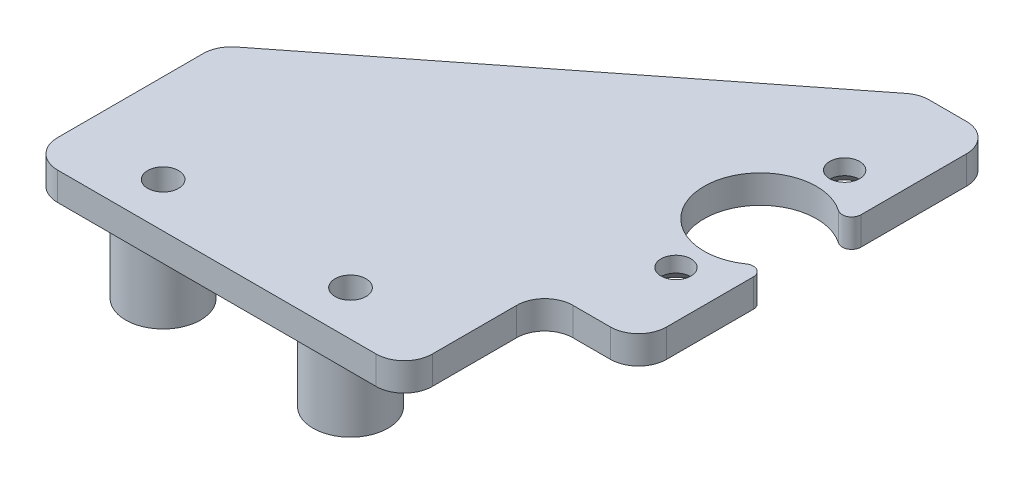
ISO-10303-21;
HEADER;
FILE_DESCRIPTION(('STEP AP214'),'2;1');
FILE_NAME('part.step','',(''),(''),'','','');
FILE_SCHEMA(('AUTOMOTIVE_DESIGN { 1 0 10303 214 1 1 1 1 }'));
ENDSEC;
DATA;
#1=APPLICATION_CONTEXT('core data for automotive mechanical design processes');
#2=APPLICATION_PROTOCOL_DEFINITION('international standard','automotive_design',2000,#1);
#3=PRODUCT_CONTEXT('',#1,'mechanical');
#4=PRODUCT('Part','Part','',(#3));
#5=PRODUCT_RELATED_PRODUCT_CATEGORY('part','',(#4));
#6=PRODUCT_DEFINITION_FORMATION('','',#4);
#7=PRODUCT_DEFINITION_CONTEXT('part definition',#1,'design');
#8=PRODUCT_DEFINITION('design','',#6,#7);
#9=PRODUCT_DEFINITION_SHAPE('','',#8);
#10=(LENGTH_UNIT() NAMED_UNIT(*) SI_UNIT(.MILLI.,.METRE.));
#11=(NAMED_UNIT(*) PLANE_ANGLE_UNIT() SI_UNIT($,.RADIAN.));
#12=(NAMED_UNIT(*) SI_UNIT($,.STERADIAN.) SOLID_ANGLE_UNIT());
#13=UNCERTAINTY_MEASURE_WITH_UNIT(LENGTH_MEASURE(1.E-05),#10,'distance_accuracy_value','');
#14=(GEOMETRIC_REPRESENTATION_CONTEXT(3) GLOBAL_UNCERTAINTY_ASSIGNED_CONTEXT((#13)) GLOBAL_UNIT_ASSIGNED_CONTEXT((#10,
#11,#12)) REPRESENTATION_CONTEXT('',''));
#15=CARTESIAN_POINT('',(0.,0.,0.));
#16=DIRECTION('',(0.,0.,1.));
#17=DIRECTION('',(1.,0.,0.));
#18=AXIS2_PLACEMENT_3D('',#15,#16,#17);
#19=CARTESIAN_POINT('',(0.,3.,-20.));
#20=DIRECTION('',(0.,0.,-1.));
#21=DIRECTION('',(-1.,0.,0.));
#22=AXIS2_PLACEMENT_3D('',#19,#20,#21);
#23=PLANE('',#22);
#24=DIRECTION('',(1.,0.,0.));
#25=VECTOR('',#24,1.);
#26=CARTESIAN_POINT('',(0.,3.,-20.));
#27=LINE('',#26,#25);
#28=CARTESIAN_POINT('',(18.0375892222086,3.,-20.));
#29=VERTEX_POINT('',#28);
#30=CARTESIAN_POINT('',(22.,3.,-20.));
#31=VERTEX_POINT('',#30);
#32=EDGE_CURVE('E411',#29,#31,#27,.T.);
#33=ORIENTED_EDGE('',*,*,#32,.T.);
#34=DIRECTION('',(0.,-1.,0.));
#35=VECTOR('',#34,1.);
#36=CARTESIAN_POINT('',(22.,3.,-20.));
#37=LINE('',#36,#35);
#38=CARTESIAN_POINT('',(22.,0.,-20.));
#39=VERTEX_POINT('',#38);
#40=EDGE_CURVE('E318',#31,#39,#37,.T.);
#41=ORIENTED_EDGE('',*,*,#40,.T.);
#42=DIRECTION('',(1.,0.,0.));
#43=VECTOR('',#42,1.);
#44=CARTESIAN_POINT('',(0.,0.,-20.));
#45=LINE('',#44,#43);
#46=CARTESIAN_POINT('',(18.0375892222086,0.,-20.));
#47=VERTEX_POINT('',#46);
#48=EDGE_CURVE('E181',#47,#39,#45,.T.);
#49=ORIENTED_EDGE('',*,*,#48,.F.);
#50=DIRECTION('',(0.,-1.,0.));
#51=VECTOR('',#50,1.);
#52=CARTESIAN_POINT('',(18.0375892222086,3.,-20.));
#53=LINE('',#52,#51);
#54=EDGE_CURVE('E315',#47,#29,#53,.F.);
#55=ORIENTED_EDGE('',*,*,#54,.T.);
#56=EDGE_LOOP('',(#33,#41,#49,#55));
#57=FACE_BOUND('',#56,.T.);
#58=ADVANCED_FACE('F43',(#57),#23,.T.);
#59=CARTESIAN_POINT('',(-25.,3.,0.));
#60=DIRECTION('',(-1.,0.,0.));
#61=DIRECTION('',(0.,0.,1.));
#62=AXIS2_PLACEMENT_3D('',#59,#60,#61);
#63=PLANE('',#62);
#64=DIRECTION('',(0.,0.,-1.));
#65=VECTOR('',#64,1.);
#66=CARTESIAN_POINT('',(-25.,3.,0.));
#67=LINE('',#66,#65);
#68=CARTESIAN_POINT('',(-25.,3.,30.));
#69=VERTEX_POINT('',#68);
#70=CARTESIAN_POINT('',(-25.,3.,14.4581058174496));
#71=VERTEX_POINT('',#70);
#72=EDGE_CURVE('E420',#69,#71,#67,.T.);
#73=ORIENTED_EDGE('',*,*,#72,.T.);
#74=DIRECTION('',(0.,-1.,0.));
#75=VECTOR('',#74,1.);
#76=CARTESIAN_POINT('',(-25.,3.,14.4581058174496));
#77=LINE('',#76,#75);
#78=CARTESIAN_POINT('',(-25.,0.,14.4581058174496));
#79=VERTEX_POINT('',#78);
#80=EDGE_CURVE('E259',#71,#79,#77,.T.);
#81=ORIENTED_EDGE('',*,*,#80,.T.);
#82=DIRECTION('',(0.,0.,-1.));
#83=VECTOR('',#82,1.);
#84=CARTESIAN_POINT('',(-25.,0.,0.));
#85=LINE('',#84,#83);
#86=CARTESIAN_POINT('',(-25.,0.,30.));
#87=VERTEX_POINT('',#86);
#88=EDGE_CURVE('E209',#87,#79,#85,.T.);
#89=ORIENTED_EDGE('',*,*,#88,.F.);
#90=DIRECTION('',(0.,-1.,0.));
#91=VECTOR('',#90,1.);
#92=CARTESIAN_POINT('',(-25.,3.,30.));
#93=LINE('',#92,#91);
#94=EDGE_CURVE('E256',#87,#69,#93,.F.);
#95=ORIENTED_EDGE('',*,*,#94,.T.);
#96=EDGE_LOOP('',(#73,#81,#89,#95));
#97=FACE_BOUND('',#96,.T.);
#98=ADVANCED_FACE('F371',(#97),#63,.T.);
#99=CARTESIAN_POINT('',(25.,3.,0.));
#100=DIRECTION('',(1.,0.,0.));
#101=DIRECTION('',(0.,0.,-1.));
#102=AXIS2_PLACEMENT_3D('',#99,#100,#101);
#103=PLANE('',#102);
#104=DIRECTION('',(0.,0.,1.));
#105=VECTOR('',#104,1.);
#106=CARTESIAN_POINT('',(25.,3.,0.));
#107=LINE('',#106,#105);
#108=CARTESIAN_POINT('',(25.,3.,5.74456264653803));
#109=VERTEX_POINT('',#108);
#110=CARTESIAN_POINT('',(25.,3.,15.));
#111=VERTEX_POINT('',#110);
#112=EDGE_CURVE('E406',#109,#111,#107,.T.);
#113=ORIENTED_EDGE('',*,*,#112,.T.);
#114=DIRECTION('',(0.,-1.,0.));
#115=VECTOR('',#114,1.);
#116=CARTESIAN_POINT('',(25.,3.,15.));
#117=LINE('',#116,#115);
#118=CARTESIAN_POINT('',(25.,0.,15.));
#119=VERTEX_POINT('',#118);
#120=EDGE_CURVE('E311',#111,#119,#117,.T.);
#121=ORIENTED_EDGE('',*,*,#120,.T.);
#122=DIRECTION('',(0.,0.,1.));
#123=VECTOR('',#122,1.);
#124=CARTESIAN_POINT('',(25.,0.,0.));
#125=LINE('',#124,#123);
#126=CARTESIAN_POINT('',(25.,0.,5.74456264653803));
#127=VERTEX_POINT('',#126);
#128=EDGE_CURVE('E184',#127,#119,#125,.T.);
#129=ORIENTED_EDGE('',*,*,#128,.F.);
#130=DIRECTION('',(0.,-1.,0.));
#131=VECTOR('',#130,1.);
#132=CARTESIAN_POINT('',(25.,3.,5.74456264653803));
#133=LINE('',#132,#131);
#134=EDGE_CURVE('E223',#127,#109,#133,.F.);
#135=ORIENTED_EDGE('',*,*,#134,.T.);
#136=EDGE_LOOP('',(#113,#121,#129,#135));
#137=FACE_BOUND('',#136,.T.);
#138=ADVANCED_FACE('F377',(#137),#103,.T.);
#139=CARTESIAN_POINT('',(0.,3.,0.));
#140=DIRECTION('',(0.,1.,0.));
#141=DIRECTION('',(0.,0.,1.));
#142=AXIS2_PLACEMENT_3D('',#139,#140,#141);
#143=PLANE('',#142);
#144=CARTESIAN_POINT('',(-15.5,3.,28.234562646538));
#145=DIRECTION('',(0.,-1.,0.));
#146=DIRECTION('',(0.,0.,-1.));
#147=AXIS2_PLACEMENT_3D('',#144,#145,#146);
#148=CIRCLE('',#147,1.65);
#149=CARTESIAN_POINT('',(-15.5,3.,26.584562646538));
#150=VERTEX_POINT('',#149);
#151=EDGE_CURVE('E451',#150,#150,#148,.T.);
#152=ORIENTED_EDGE('',*,*,#151,.T.);
#153=EDGE_LOOP('',(#152));
#154=FACE_BOUND('',#153,.T.);
#155=CARTESIAN_POINT('',(4.5,3.,28.234562646538));
#156=DIRECTION('',(0.,-1.,0.));
#157=DIRECTION('',(0.,0.,-1.));
#158=AXIS2_PLACEMENT_3D('',#155,#156,#157);
#159=CIRCLE('',#158,1.65);
#160=CARTESIAN_POINT('',(4.5,3.,26.584562646538));
#161=VERTEX_POINT('',#160);
#162=EDGE_CURVE('E453',#161,#161,#159,.T.);
#163=ORIENTED_EDGE('',*,*,#162,.T.);
#164=EDGE_LOOP('',(#163));
#165=FACE_BOUND('',#164,.T.);
#166=CARTESIAN_POINT('',(20.,3.,9.));
#167=DIRECTION('',(0.,1.,0.));
#168=DIRECTION('',(0.,0.,1.));
#169=AXIS2_PLACEMENT_3D('',#166,#167,#168);
#170=CIRCLE('',#169,1.6);
#171=CARTESIAN_POINT('',(20.,3.,10.6));
#172=VERTEX_POINT('',#171);
#173=EDGE_CURVE('E206',#172,#172,#170,.T.);
#174=ORIENTED_EDGE('',*,*,#173,.F.);
#175=EDGE_LOOP('',(#174));
#176=FACE_BOUND('',#175,.T.);
#177=CARTESIAN_POINT('',(20.,3.,-9.));
#178=DIRECTION('',(0.,1.,0.));
#179=DIRECTION('',(0.,0.,1.));
#180=AXIS2_PLACEMENT_3D('',#177,#178,#179);
#181=CIRCLE('',#180,1.6);
#182=CARTESIAN_POINT('',(20.,3.,-7.4));
#183=VERTEX_POINT('',#182);
#184=EDGE_CURVE('E200',#183,#183,#181,.T.);
#185=ORIENTED_EDGE('',*,*,#184,.F.);
#186=EDGE_LOOP('',(#185));
#187=FACE_BOUND('',#186,.T.);
#188=DIRECTION('',(0.786318338822423,0.,-0.617821551931904));
#189=VECTOR('',#188,1.);
#190=CARTESIAN_POINT('',(-25.,3.,13.));
#191=LINE('',#190,#189);
#192=CARTESIAN_POINT('',(-23.8534646557957,3.,12.0991508009823));
#193=VERTEX_POINT('',#192);
#194=CARTESIAN_POINT('',(16.1841245664129,3.,-19.3589550164673));
#195=VERTEX_POINT('',#194);
#196=EDGE_CURVE('E457',#193,#195,#191,.T.);
#197=ORIENTED_EDGE('',*,*,#196,.F.);
#198=CARTESIAN_POINT('',(-22.,3.,14.4581058174496));
#199=DIRECTION('',(0.,1.,0.));
#200=DIRECTION('',(0.,0.,1.));
#201=AXIS2_PLACEMENT_3D('',#198,#199,#200);
#202=CIRCLE('',#201,3.);
#203=EDGE_CURVE('E301',#193,#71,#202,.T.);
#204=ORIENTED_EDGE('',*,*,#203,.T.);
#205=ORIENTED_EDGE('',*,*,#72,.F.);
#206=CARTESIAN_POINT('',(-22.,3.,30.));
#207=DIRECTION('',(0.,1.,0.));
#208=DIRECTION('',(0.,0.,1.));
#209=AXIS2_PLACEMENT_3D('',#206,#207,#208);
#210=CIRCLE('',#209,3.);
#211=CARTESIAN_POINT('',(-22.,3.,33.));
#212=VERTEX_POINT('',#211);
#213=EDGE_CURVE('E298',#69,#212,#210,.T.);
#214=ORIENTED_EDGE('',*,*,#213,.T.);
#215=DIRECTION('',(-1.,0.,0.));
#216=VECTOR('',#215,1.);
#217=CARTESIAN_POINT('',(-25.,3.,33.));
#218=LINE('',#217,#216);
#219=CARTESIAN_POINT('',(12.,3.,33.));
#220=VERTEX_POINT('',#219);
#221=EDGE_CURVE('E428',#220,#212,#218,.T.);
#222=ORIENTED_EDGE('',*,*,#221,.F.);
#223=CARTESIAN_POINT('',(12.,3.,30.));
#224=DIRECTION('',(0.,1.,0.));
#225=DIRECTION('',(0.,0.,1.));
#226=AXIS2_PLACEMENT_3D('',#223,#224,#225);
#227=CIRCLE('',#226,3.);
#228=CARTESIAN_POINT('',(15.,3.,30.));
#229=VERTEX_POINT('',#228);
#230=EDGE_CURVE('E295',#220,#229,#227,.T.);
#231=ORIENTED_EDGE('',*,*,#230,.T.);
#232=DIRECTION('',(0.,0.,1.));
#233=VECTOR('',#232,1.);
#234=CARTESIAN_POINT('',(15.,3.,18.));
#235=LINE('',#234,#233);
#236=CARTESIAN_POINT('',(15.,3.,21.));
#237=VERTEX_POINT('',#236);
#238=EDGE_CURVE('E461',#237,#229,#235,.T.);
#239=ORIENTED_EDGE('',*,*,#238,.F.);
#240=CARTESIAN_POINT('',(18.,3.,21.));
#241=DIRECTION('',(0.,1.,0.));
#242=DIRECTION('',(0.,0.,1.));
#243=AXIS2_PLACEMENT_3D('',#240,#241,#242);
#244=CIRCLE('',#243,3.);
#245=CARTESIAN_POINT('',(18.,3.,18.));
#246=VERTEX_POINT('',#245);
#247=EDGE_CURVE('E327',#237,#246,#244,.F.);
#248=ORIENTED_EDGE('',*,*,#247,.T.);
#249=DIRECTION('',(-1.,0.,0.));
#250=VECTOR('',#249,1.);
#251=CARTESIAN_POINT('',(25.,3.,18.));
#252=LINE('',#251,#250);
#253=CARTESIAN_POINT('',(22.,3.,18.));
#254=VERTEX_POINT('',#253);
#255=EDGE_CURVE('E466',#254,#246,#252,.T.);
#256=ORIENTED_EDGE('',*,*,#255,.F.);
#257=CARTESIAN_POINT('',(22.,3.,15.));
#258=DIRECTION('',(0.,1.,0.));
#259=DIRECTION('',(0.,0.,1.));
#260=AXIS2_PLACEMENT_3D('',#257,#258,#259);
#261=CIRCLE('',#260,3.);
#262=EDGE_CURVE('E67',#254,#111,#261,.T.);
#263=ORIENTED_EDGE('',*,*,#262,.T.);
#264=ORIENTED_EDGE('',*,*,#112,.F.);
#265=CARTESIAN_POINT('',(24.,3.,5.74456264653803));
#266=DIRECTION('',(0.,1.,0.));
#267=DIRECTION('',(0.,0.,1.));
#268=AXIS2_PLACEMENT_3D('',#265,#266,#267);
#269=CIRCLE('',#268,1.);
#270=CARTESIAN_POINT('',(23.4285714285714,3.,4.92391083988974));
#271=VERTEX_POINT('',#270);
#272=EDGE_CURVE('E217',#109,#271,#269,.T.);
#273=ORIENTED_EDGE('',*,*,#272,.T.);
#274=CARTESIAN_POINT('',(20.,3.,0.));
#275=DIRECTION('',(0.,1.,0.));
#276=DIRECTION('',(0.,0.,1.));
#277=AXIS2_PLACEMENT_3D('',#274,#275,#276);
#278=CIRCLE('',#277,6.);
#279=CARTESIAN_POINT('',(23.4285714285714,3.,-4.92391083988974));
#280=VERTEX_POINT('',#279);
#281=EDGE_CURVE('E405',#280,#271,#278,.T.);
#282=ORIENTED_EDGE('',*,*,#281,.F.);
#283=CARTESIAN_POINT('',(24.,3.,-5.74456264653803));
#284=DIRECTION('',(0.,1.,0.));
#285=DIRECTION('',(0.,0.,1.));
#286=AXIS2_PLACEMENT_3D('',#283,#284,#285);
#287=CIRCLE('',#286,1.);
#288=CARTESIAN_POINT('',(25.,3.,-5.74456264653803));
#289=VERTEX_POINT('',#288);
#290=EDGE_CURVE('E220',#280,#289,#287,.T.);
#291=ORIENTED_EDGE('',*,*,#290,.T.);
#292=CARTESIAN_POINT('',(25.,3.,-17.));
#293=VERTEX_POINT('',#292);
#294=EDGE_CURVE('E197',#293,#289,#107,.T.);
#295=ORIENTED_EDGE('',*,*,#294,.F.);
#296=CARTESIAN_POINT('',(22.,3.,-17.));
#297=DIRECTION('',(0.,1.,0.));
#298=DIRECTION('',(0.,0.,1.));
#299=AXIS2_PLACEMENT_3D('',#296,#297,#298);
#300=CIRCLE('',#299,3.);
#301=EDGE_CURVE('E290',#293,#31,#300,.T.);
#302=ORIENTED_EDGE('',*,*,#301,.T.);
#303=ORIENTED_EDGE('',*,*,#32,.F.);
#304=CARTESIAN_POINT('',(18.0375892222086,3.,-17.));
#305=DIRECTION('',(0.,1.,0.));
#306=DIRECTION('',(0.,0.,1.));
#307=AXIS2_PLACEMENT_3D('',#304,#305,#306);
#308=CIRCLE('',#307,3.);
#309=EDGE_CURVE('E287',#29,#195,#308,.T.);
#310=ORIENTED_EDGE('',*,*,#309,.T.);
#311=EDGE_LOOP('',(#197,#204,#205,#214,#222,#231,#239,#248,#256,#263,#264,#273,#282,#291,#295,
#302,#303,#310));
#312=FACE_BOUND('',#311,.T.);
#313=ADVANCED_FACE('F342',(#154,#165,#176,#187,#312),#143,.T.);
#314=CARTESIAN_POINT('',(0.,0.,0.));
#315=DIRECTION('',(0.,1.,0.));
#316=DIRECTION('',(0.,0.,1.));
#317=AXIS2_PLACEMENT_3D('',#314,#315,#316);
#318=PLANE('',#317);
#319=CARTESIAN_POINT('',(-5.5,0.,10.234562646538));
#320=DIRECTION('',(0.,1.,0.));
#321=DIRECTION('',(0.,0.,1.));
#322=AXIS2_PLACEMENT_3D('',#319,#320,#321);
#323=CIRCLE('',#322,4.);
#324=CARTESIAN_POINT('',(-5.5,0.,14.234562646538));
#325=VERTEX_POINT('',#324);
#326=EDGE_CURVE('E11',#325,#325,#323,.F.);
#327=ORIENTED_EDGE('',*,*,#326,.F.);
#328=EDGE_LOOP('',(#327));
#329=FACE_BOUND('',#328,.T.);
#330=CARTESIAN_POINT('',(4.5,0.,28.234562646538));
#331=DIRECTION('',(0.,1.,0.));
#332=DIRECTION('',(0.,0.,1.));
#333=AXIS2_PLACEMENT_3D('',#330,#331,#332);
#334=CIRCLE('',#333,4.);
#335=CARTESIAN_POINT('',(4.5,0.,32.234562646538));
#336=VERTEX_POINT('',#335);
#337=EDGE_CURVE('E52',#336,#336,#334,.F.);
#338=ORIENTED_EDGE('',*,*,#337,.F.);
#339=EDGE_LOOP('',(#338));
#340=FACE_BOUND('',#339,.T.);
#341=CARTESIAN_POINT('',(-15.5,0.,28.234562646538));
#342=DIRECTION('',(0.,1.,0.));
#343=DIRECTION('',(0.,0.,1.));
#344=AXIS2_PLACEMENT_3D('',#341,#342,#343);
#345=CIRCLE('',#344,4.);
#346=CARTESIAN_POINT('',(-15.5,0.,32.234562646538));
#347=VERTEX_POINT('',#346);
#348=EDGE_CURVE('E330',#347,#347,#345,.F.);
#349=ORIENTED_EDGE('',*,*,#348,.F.);
#350=EDGE_LOOP('',(#349));
#351=FACE_BOUND('',#350,.T.);
#352=CARTESIAN_POINT('',(20.,0.,-9.));
#353=DIRECTION('',(0.,1.,0.));
#354=DIRECTION('',(0.,0.,1.));
#355=AXIS2_PLACEMENT_3D('',#352,#353,#354);
#356=CIRCLE('',#355,2.94999999999999);
#357=CARTESIAN_POINT('',(20.,0.,-6.05000000000001));
#358=VERTEX_POINT('',#357);
#359=EDGE_CURVE('E230',#358,#358,#356,.T.);
#360=ORIENTED_EDGE('',*,*,#359,.T.);
#361=EDGE_LOOP('',(#360));
#362=FACE_BOUND('',#361,.T.);
#363=CARTESIAN_POINT('',(20.,0.,9.));
#364=DIRECTION('',(0.,1.,0.));
#365=DIRECTION('',(0.,0.,1.));
#366=AXIS2_PLACEMENT_3D('',#363,#364,#365);
#367=CIRCLE('',#366,2.95);
#368=CARTESIAN_POINT('',(20.,0.,11.95));
#369=VERTEX_POINT('',#368);
#370=EDGE_CURVE('E226',#369,#369,#367,.T.);
#371=ORIENTED_EDGE('',*,*,#370,.T.);
#372=EDGE_LOOP('',(#371));
#373=FACE_BOUND('',#372,.T.);
#374=ORIENTED_EDGE('',*,*,#88,.T.);
#375=CARTESIAN_POINT('',(-22.,0.,14.4581058174496));
#376=DIRECTION('',(0.,1.,0.));
#377=DIRECTION('',(0.,0.,1.));
#378=AXIS2_PLACEMENT_3D('',#375,#376,#377);
#379=CIRCLE('',#378,3.);
#380=CARTESIAN_POINT('',(-23.8534646557957,0.,12.0991508009823));
#381=VERTEX_POINT('',#380);
#382=EDGE_CURVE('E277',#79,#381,#379,.F.);
#383=ORIENTED_EDGE('',*,*,#382,.T.);
#384=DIRECTION('',(0.786318338822423,0.,-0.617821551931904));
#385=VECTOR('',#384,1.);
#386=CARTESIAN_POINT('',(-25.,0.,13.));
#387=LINE('',#386,#385);
#388=CARTESIAN_POINT('',(16.1841245664129,0.,-19.3589550164673));
#389=VERTEX_POINT('',#388);
#390=EDGE_CURVE('E475',#381,#389,#387,.T.);
#391=ORIENTED_EDGE('',*,*,#390,.T.);
#392=CARTESIAN_POINT('',(18.0375892222086,0.,-17.));
#393=DIRECTION('',(0.,1.,0.));
#394=DIRECTION('',(0.,0.,1.));
#395=AXIS2_PLACEMENT_3D('',#392,#393,#394);
#396=CIRCLE('',#395,3.);
#397=EDGE_CURVE('E263',#389,#47,#396,.F.);
#398=ORIENTED_EDGE('',*,*,#397,.T.);
#399=ORIENTED_EDGE('',*,*,#48,.T.);
#400=CARTESIAN_POINT('',(22.,0.,-17.));
#401=DIRECTION('',(0.,1.,0.));
#402=DIRECTION('',(0.,0.,1.));
#403=AXIS2_PLACEMENT_3D('',#400,#401,#402);
#404=CIRCLE('',#403,3.);
#405=CARTESIAN_POINT('',(25.,0.,-17.));
#406=VERTEX_POINT('',#405);
#407=EDGE_CURVE('E178',#39,#406,#404,.F.);
#408=ORIENTED_EDGE('',*,*,#407,.T.);
#409=CARTESIAN_POINT('',(25.,0.,-5.74456264653803));
#410=VERTEX_POINT('',#409);
#411=EDGE_CURVE('E170',#406,#410,#125,.T.);
#412=ORIENTED_EDGE('',*,*,#411,.T.);
#413=CARTESIAN_POINT('',(24.,0.,-5.74456264653803));
#414=DIRECTION('',(0.,1.,0.));
#415=DIRECTION('',(0.,0.,1.));
#416=AXIS2_PLACEMENT_3D('',#413,#414,#415);
#417=CIRCLE('',#416,1.);
#418=CARTESIAN_POINT('',(23.4285714285714,0.,-4.92391083988974));
#419=VERTEX_POINT('',#418);
#420=EDGE_CURVE('E175',#410,#419,#417,.F.);
#421=ORIENTED_EDGE('',*,*,#420,.T.);
#422=CARTESIAN_POINT('',(20.,0.,0.));
#423=DIRECTION('',(0.,1.,0.));
#424=DIRECTION('',(0.,0.,1.));
#425=AXIS2_PLACEMENT_3D('',#422,#423,#424);
#426=CIRCLE('',#425,6.);
#427=CARTESIAN_POINT('',(23.4285714285714,0.,4.92391083988974));
#428=VERTEX_POINT('',#427);
#429=EDGE_CURVE('E182',#419,#428,#426,.T.);
#430=ORIENTED_EDGE('',*,*,#429,.T.);
#431=CARTESIAN_POINT('',(24.,0.,5.74456264653803));
#432=DIRECTION('',(0.,1.,0.));
#433=DIRECTION('',(0.,0.,1.));
#434=AXIS2_PLACEMENT_3D('',#431,#432,#433);
#435=CIRCLE('',#434,1.);
#436=EDGE_CURVE('E194',#428,#127,#435,.F.);
#437=ORIENTED_EDGE('',*,*,#436,.T.);
#438=ORIENTED_EDGE('',*,*,#128,.T.);
#439=CARTESIAN_POINT('',(22.,0.,15.));
#440=DIRECTION('',(0.,1.,0.));
#441=DIRECTION('',(0.,0.,1.));
#442=AXIS2_PLACEMENT_3D('',#439,#440,#441);
#443=CIRCLE('',#442,3.);
#444=CARTESIAN_POINT('',(22.,0.,18.));
#445=VERTEX_POINT('',#444);
#446=EDGE_CURVE('E268',#119,#445,#443,.F.);
#447=ORIENTED_EDGE('',*,*,#446,.T.);
#448=DIRECTION('',(-1.,0.,0.));
#449=VECTOR('',#448,1.);
#450=CARTESIAN_POINT('',(25.,0.,18.));
#451=LINE('',#450,#449);
#452=CARTESIAN_POINT('',(18.,0.,18.));
#453=VERTEX_POINT('',#452);
#454=EDGE_CURVE('E465',#445,#453,#451,.T.);
#455=ORIENTED_EDGE('',*,*,#454,.T.);
#456=CARTESIAN_POINT('',(18.,0.,21.));
#457=DIRECTION('',(0.,1.,0.));
#458=DIRECTION('',(0.,0.,1.));
#459=AXIS2_PLACEMENT_3D('',#456,#457,#458);
#460=CIRCLE('',#459,3.);
#461=CARTESIAN_POINT('',(15.,0.,21.));
#462=VERTEX_POINT('',#461);
#463=EDGE_CURVE('E324',#453,#462,#460,.T.);
#464=ORIENTED_EDGE('',*,*,#463,.T.);
#465=DIRECTION('',(0.,0.,1.));
#466=VECTOR('',#465,1.);
#467=CARTESIAN_POINT('',(15.,0.,18.));
#468=LINE('',#467,#466);
#469=CARTESIAN_POINT('',(15.,0.,30.));
#470=VERTEX_POINT('',#469);
#471=EDGE_CURVE('E471',#462,#470,#468,.T.);
#472=ORIENTED_EDGE('',*,*,#471,.T.);
#473=CARTESIAN_POINT('',(12.,0.,30.));
#474=DIRECTION('',(0.,1.,0.));
#475=DIRECTION('',(0.,0.,1.));
#476=AXIS2_PLACEMENT_3D('',#473,#474,#475);
#477=CIRCLE('',#476,3.);
#478=CARTESIAN_POINT('',(12.,0.,33.));
#479=VERTEX_POINT('',#478);
#480=EDGE_CURVE('E271',#470,#479,#477,.F.);
#481=ORIENTED_EDGE('',*,*,#480,.T.);
#482=DIRECTION('',(-1.,0.,0.));
#483=VECTOR('',#482,1.);
#484=CARTESIAN_POINT('',(-25.,0.,33.));
#485=LINE('',#484,#483);
#486=CARTESIAN_POINT('',(-22.,0.,33.));
#487=VERTEX_POINT('',#486);
#488=EDGE_CURVE('E415',#479,#487,#485,.T.);
#489=ORIENTED_EDGE('',*,*,#488,.T.);
#490=CARTESIAN_POINT('',(-22.,0.,30.));
#491=DIRECTION('',(0.,1.,0.));
#492=DIRECTION('',(0.,0.,1.));
#493=AXIS2_PLACEMENT_3D('',#490,#491,#492);
#494=CIRCLE('',#493,3.);
#495=EDGE_CURVE('E274',#487,#87,#494,.F.);
#496=ORIENTED_EDGE('',*,*,#495,.T.);
#497=EDGE_LOOP('',(#374,#383,#391,#398,#399,#408,#412,#421,#430,#437,#438,#447,#455,#464,#472,
#481,#489,#496));
#498=FACE_BOUND('',#497,.T.);
#499=ADVANCED_FACE('F173',(#329,#340,#351,#362,#373,#498),#318,.F.);
#500=CARTESIAN_POINT('',(-25.,3.,33.));
#501=DIRECTION('',(0.,0.,1.));
#502=DIRECTION('',(1.,0.,0.));
#503=AXIS2_PLACEMENT_3D('',#500,#501,#502);
#504=PLANE('',#503);
#505=ORIENTED_EDGE('',*,*,#221,.T.);
#506=DIRECTION('',(0.,-1.,0.));
#507=VECTOR('',#506,1.);
#508=CARTESIAN_POINT('',(-22.,3.,33.));
#509=LINE('',#508,#507);
#510=EDGE_CURVE('E307',#212,#487,#509,.T.);
#511=ORIENTED_EDGE('',*,*,#510,.T.);
#512=ORIENTED_EDGE('',*,*,#488,.F.);
#513=DIRECTION('',(0.,-1.,0.));
#514=VECTOR('',#513,1.);
#515=CARTESIAN_POINT('',(12.,3.,33.));
#516=LINE('',#515,#514);
#517=EDGE_CURVE('E304',#479,#220,#516,.F.);
#518=ORIENTED_EDGE('',*,*,#517,.T.);
#519=EDGE_LOOP('',(#505,#511,#512,#518));
#520=FACE_BOUND('',#519,.T.);
#521=ADVANCED_FACE('F341',(#520),#504,.T.);
#522=CARTESIAN_POINT('',(20.,3.,0.));
#523=DIRECTION('',(0.,-1.,0.));
#524=DIRECTION('',(0.,0.,-1.));
#525=AXIS2_PLACEMENT_3D('',#522,#523,#524);
#526=CYLINDRICAL_SURFACE('',#525,6.);
#527=ORIENTED_EDGE('',*,*,#429,.F.);
#528=DIRECTION('',(0.,-1.,0.));
#529=VECTOR('',#528,1.);
#530=CARTESIAN_POINT('',(23.4285714285714,3.,-4.92391083988974));
#531=LINE('',#530,#529);
#532=EDGE_CURVE('E191',#419,#280,#531,.F.);
#533=ORIENTED_EDGE('',*,*,#532,.T.);
#534=ORIENTED_EDGE('',*,*,#281,.T.);
#535=DIRECTION('',(0.,-1.,0.));
#536=VECTOR('',#535,1.);
#537=CARTESIAN_POINT('',(23.4285714285714,3.,4.92391083988974));
#538=LINE('',#537,#536);
#539=EDGE_CURVE('E193',#271,#428,#538,.T.);
#540=ORIENTED_EDGE('',*,*,#539,.T.);
#541=EDGE_LOOP('',(#527,#533,#534,#540));
#542=FACE_BOUND('',#541,.T.);
#543=ADVANCED_FACE('F383',(#542),#526,.F.);
#544=ORIENTED_EDGE('',*,*,#411,.F.);
#545=DIRECTION('',(0.,-1.,0.));
#546=VECTOR('',#545,1.);
#547=CARTESIAN_POINT('',(25.,3.,-17.));
#548=LINE('',#547,#546);
#549=EDGE_CURVE('E59',#406,#293,#548,.F.);
#550=ORIENTED_EDGE('',*,*,#549,.T.);
#551=ORIENTED_EDGE('',*,*,#294,.T.);
#552=DIRECTION('',(0.,-1.,0.));
#553=VECTOR('',#552,1.);
#554=CARTESIAN_POINT('',(25.,3.,-5.74456264653803));
#555=LINE('',#554,#553);
#556=EDGE_CURVE('E190',#289,#410,#555,.T.);
#557=ORIENTED_EDGE('',*,*,#556,.T.);
#558=EDGE_LOOP('',(#544,#550,#551,#557));
#559=FACE_BOUND('',#558,.T.);
#560=ADVANCED_FACE('F196',(#559),#103,.T.);
#561=CARTESIAN_POINT('',(20.,3.,9.));
#562=DIRECTION('',(0.,-1.,0.));
#563=DIRECTION('',(0.,0.,-1.));
#564=AXIS2_PLACEMENT_3D('',#561,#562,#563);
#565=CYLINDRICAL_SURFACE('',#564,1.6);
#566=CARTESIAN_POINT('',(20.,1.35,9.));
#567=DIRECTION('',(0.,1.,0.));
#568=DIRECTION('',(0.,0.,1.));
#569=AXIS2_PLACEMENT_3D('',#566,#567,#568);
#570=CIRCLE('',#569,1.6);
#571=CARTESIAN_POINT('',(20.,1.35,10.6));
#572=VERTEX_POINT('',#571);
#573=EDGE_CURVE('E238',#572,#572,#570,.F.);
#574=ORIENTED_EDGE('',*,*,#573,.T.);
#575=EDGE_LOOP('',(#574));
#576=FACE_BOUND('',#575,.T.);
#577=ORIENTED_EDGE('',*,*,#173,.T.);
#578=EDGE_LOOP('',(#577));
#579=FACE_BOUND('',#578,.T.);
#580=ADVANCED_FACE('F545',(#576,#579),#565,.F.);
#581=CARTESIAN_POINT('',(20.,3.,-9.));
#582=DIRECTION('',(0.,-1.,0.));
#583=DIRECTION('',(0.,0.,-1.));
#584=AXIS2_PLACEMENT_3D('',#581,#582,#583);
#585=CYLINDRICAL_SURFACE('',#584,1.6);
#586=CARTESIAN_POINT('',(20.,1.35,-9.));
#587=DIRECTION('',(0.,1.,0.));
#588=DIRECTION('',(0.,0.,1.));
#589=AXIS2_PLACEMENT_3D('',#586,#587,#588);
#590=CIRCLE('',#589,1.6);
#591=CARTESIAN_POINT('',(20.,1.35,-7.4));
#592=VERTEX_POINT('',#591);
#593=EDGE_CURVE('E234',#592,#592,#590,.F.);
#594=ORIENTED_EDGE('',*,*,#593,.T.);
#595=EDGE_LOOP('',(#594));
#596=FACE_BOUND('',#595,.T.);
#597=ORIENTED_EDGE('',*,*,#184,.T.);
#598=EDGE_LOOP('',(#597));
#599=FACE_BOUND('',#598,.T.);
#600=ADVANCED_FACE('F389',(#596,#599),#585,.F.);
#601=CARTESIAN_POINT('',(24.,3.,-5.74456264653803));
#602=DIRECTION('',(0.,-1.,0.));
#603=DIRECTION('',(0.,0.,-1.));
#604=AXIS2_PLACEMENT_3D('',#601,#602,#603);
#605=CYLINDRICAL_SURFACE('',#604,1.);
#606=ORIENTED_EDGE('',*,*,#290,.F.);
#607=ORIENTED_EDGE('',*,*,#532,.F.);
#608=ORIENTED_EDGE('',*,*,#420,.F.);
#609=ORIENTED_EDGE('',*,*,#556,.F.);
#610=EDGE_LOOP('',(#606,#607,#608,#609));
#611=FACE_BOUND('',#610,.T.);
#612=ADVANCED_FACE('F189',(#611),#605,.T.);
#613=CARTESIAN_POINT('',(24.,3.,5.74456264653803));
#614=DIRECTION('',(0.,-1.,0.));
#615=DIRECTION('',(0.,0.,-1.));
#616=AXIS2_PLACEMENT_3D('',#613,#614,#615);
#617=CYLINDRICAL_SURFACE('',#616,1.);
#618=ORIENTED_EDGE('',*,*,#272,.F.);
#619=ORIENTED_EDGE('',*,*,#134,.F.);
#620=ORIENTED_EDGE('',*,*,#436,.F.);
#621=ORIENTED_EDGE('',*,*,#539,.F.);
#622=EDGE_LOOP('',(#618,#619,#620,#621));
#623=FACE_BOUND('',#622,.T.);
#624=ADVANCED_FACE('F364',(#623),#617,.T.);
#625=CARTESIAN_POINT('',(20.,0.,-9.));
#626=DIRECTION('',(0.,-1.,0.));
#627=DIRECTION('',(0.,0.,-1.));
#628=AXIS2_PLACEMENT_3D('',#625,#626,#627);
#629=CONICAL_SURFACE('',#628,2.94999999999999,0.785398163397445);
#630=ORIENTED_EDGE('',*,*,#593,.F.);
#631=EDGE_LOOP('',(#630));
#632=FACE_BOUND('',#631,.T.);
#633=ORIENTED_EDGE('',*,*,#359,.F.);
#634=EDGE_LOOP('',(#633));
#635=FACE_BOUND('',#634,.T.);
#636=ADVANCED_FACE('F354',(#632,#635),#629,.F.);
#637=CARTESIAN_POINT('',(20.,0.,9.));
#638=DIRECTION('',(0.,-1.,0.));
#639=DIRECTION('',(0.,0.,-1.));
#640=AXIS2_PLACEMENT_3D('',#637,#638,#639);
#641=CONICAL_SURFACE('',#640,2.95,0.785398163397447);
#642=ORIENTED_EDGE('',*,*,#573,.F.);
#643=EDGE_LOOP('',(#642));
#644=FACE_BOUND('',#643,.T.);
#645=ORIENTED_EDGE('',*,*,#370,.F.);
#646=EDGE_LOOP('',(#645));
#647=FACE_BOUND('',#646,.T.);
#648=ADVANCED_FACE('F351',(#644,#647),#641,.F.);
#649=CARTESIAN_POINT('',(4.5,3.,28.234562646538));
#650=DIRECTION('',(0.,-1.,0.));
#651=DIRECTION('',(0.,0.,-1.));
#652=AXIS2_PLACEMENT_3D('',#649,#650,#651);
#653=CYLINDRICAL_SURFACE('',#652,1.65);
#654=ORIENTED_EDGE('',*,*,#162,.F.);
#655=EDGE_LOOP('',(#654));
#656=FACE_BOUND('',#655,.T.);
#657=CARTESIAN_POINT('',(4.5,-8.,28.234562646538));
#658=DIRECTION('',(0.,-1.,0.));
#659=DIRECTION('',(0.,0.,-1.));
#660=AXIS2_PLACEMENT_3D('',#657,#658,#659);
#661=CIRCLE('',#660,1.65);
#662=CARTESIAN_POINT('',(4.5,-8.,26.584562646538));
#663=VERTEX_POINT('',#662);
#664=EDGE_CURVE('E496',#663,#663,#661,.T.);
#665=ORIENTED_EDGE('',*,*,#664,.T.);
#666=EDGE_LOOP('',(#665));
#667=FACE_BOUND('',#666,.T.);
#668=ADVANCED_FACE('F353',(#656,#667),#653,.F.);
#669=CARTESIAN_POINT('',(-15.5,3.,28.234562646538));
#670=DIRECTION('',(0.,-1.,0.));
#671=DIRECTION('',(0.,0.,-1.));
#672=AXIS2_PLACEMENT_3D('',#669,#670,#671);
#673=CYLINDRICAL_SURFACE('',#672,1.65);
#674=ORIENTED_EDGE('',*,*,#151,.F.);
#675=EDGE_LOOP('',(#674));
#676=FACE_BOUND('',#675,.T.);
#677=CARTESIAN_POINT('',(-15.5,-8.,28.234562646538));
#678=DIRECTION('',(0.,-1.,0.));
#679=DIRECTION('',(0.,0.,-1.));
#680=AXIS2_PLACEMENT_3D('',#677,#678,#679);
#681=CIRCLE('',#680,1.65);
#682=CARTESIAN_POINT('',(-15.5,-8.,26.584562646538));
#683=VERTEX_POINT('',#682);
#684=EDGE_CURVE('E495',#683,#683,#681,.T.);
#685=ORIENTED_EDGE('',*,*,#684,.T.);
#686=EDGE_LOOP('',(#685));
#687=FACE_BOUND('',#686,.T.);
#688=ADVANCED_FACE('F361',(#676,#687),#673,.F.);
#689=CARTESIAN_POINT('',(15.,3.,18.));
#690=DIRECTION('',(1.,0.,0.));
#691=DIRECTION('',(0.,0.,-1.));
#692=AXIS2_PLACEMENT_3D('',#689,#690,#691);
#693=PLANE('',#692);
#694=ORIENTED_EDGE('',*,*,#471,.F.);
#695=DIRECTION('',(0.,-1.,0.));
#696=VECTOR('',#695,1.);
#697=CARTESIAN_POINT('',(15.,3.,21.));
#698=LINE('',#697,#696);
#699=EDGE_CURVE('E253',#462,#237,#698,.F.);
#700=ORIENTED_EDGE('',*,*,#699,.T.);
#701=ORIENTED_EDGE('',*,*,#238,.T.);
#702=DIRECTION('',(0.,-1.,0.));
#703=VECTOR('',#702,1.);
#704=CARTESIAN_POINT('',(15.,3.,30.));
#705=LINE('',#704,#703);
#706=EDGE_CURVE('E249',#229,#470,#705,.T.);
#707=ORIENTED_EDGE('',*,*,#706,.T.);
#708=EDGE_LOOP('',(#694,#700,#701,#707));
#709=FACE_BOUND('',#708,.T.);
#710=ADVANCED_FACE('F528',(#709),#693,.T.);
#711=CARTESIAN_POINT('',(25.,3.,18.));
#712=DIRECTION('',(0.,0.,1.));
#713=DIRECTION('',(1.,0.,0.));
#714=AXIS2_PLACEMENT_3D('',#711,#712,#713);
#715=PLANE('',#714);
#716=ORIENTED_EDGE('',*,*,#255,.T.);
#717=DIRECTION('',(0.,-1.,0.));
#718=VECTOR('',#717,1.);
#719=CARTESIAN_POINT('',(18.,0.,18.));
#720=LINE('',#719,#718);
#721=EDGE_CURVE('E245',#246,#453,#720,.T.);
#722=ORIENTED_EDGE('',*,*,#721,.T.);
#723=ORIENTED_EDGE('',*,*,#454,.F.);
#724=DIRECTION('',(0.,-1.,0.));
#725=VECTOR('',#724,1.);
#726=CARTESIAN_POINT('',(22.,3.,18.));
#727=LINE('',#726,#725);
#728=EDGE_CURVE('E242',#445,#254,#727,.F.);
#729=ORIENTED_EDGE('',*,*,#728,.T.);
#730=EDGE_LOOP('',(#716,#722,#723,#729));
#731=FACE_BOUND('',#730,.T.);
#732=ADVANCED_FACE('F526',(#731),#715,.T.);
#733=CARTESIAN_POINT('',(-25.,3.,13.));
#734=DIRECTION('',(-0.617821551931904,0.,-0.786318338822423));
#735=DIRECTION('',(-0.786318338822423,0.,0.617821551931904));
#736=AXIS2_PLACEMENT_3D('',#733,#734,#735);
#737=PLANE('',#736);
#738=ORIENTED_EDGE('',*,*,#390,.F.);
#739=DIRECTION('',(0.,-1.,0.));
#740=VECTOR('',#739,1.);
#741=CARTESIAN_POINT('',(-23.8534646557957,3.,12.0991508009823));
#742=LINE('',#741,#740);
#743=EDGE_CURVE('E284',#381,#193,#742,.F.);
#744=ORIENTED_EDGE('',*,*,#743,.T.);
#745=ORIENTED_EDGE('',*,*,#196,.T.);
#746=DIRECTION('',(0.,-1.,0.));
#747=VECTOR('',#746,1.);
#748=CARTESIAN_POINT('',(16.1841245664129,3.,-19.3589550164673));
#749=LINE('',#748,#747);
#750=EDGE_CURVE('E280',#195,#389,#749,.T.);
#751=ORIENTED_EDGE('',*,*,#750,.T.);
#752=EDGE_LOOP('',(#738,#744,#745,#751));
#753=FACE_BOUND('',#752,.T.);
#754=ADVANCED_FACE('F522',(#753),#737,.T.);
#755=CARTESIAN_POINT('',(18.,3.,21.));
#756=DIRECTION('',(0.,1.,0.));
#757=DIRECTION('',(0.,0.,1.));
#758=AXIS2_PLACEMENT_3D('',#755,#756,#757);
#759=CYLINDRICAL_SURFACE('',#758,3.);
#760=ORIENTED_EDGE('',*,*,#247,.F.);
#761=ORIENTED_EDGE('',*,*,#699,.F.);
#762=ORIENTED_EDGE('',*,*,#463,.F.);
#763=ORIENTED_EDGE('',*,*,#721,.F.);
#764=EDGE_LOOP('',(#760,#761,#762,#763));
#765=FACE_BOUND('',#764,.T.);
#766=ADVANCED_FACE('F525',(#765),#759,.F.);
#767=CARTESIAN_POINT('',(-22.,3.,14.4581058174496));
#768=DIRECTION('',(0.,-1.,0.));
#769=DIRECTION('',(0.,0.,-1.));
#770=AXIS2_PLACEMENT_3D('',#767,#768,#769);
#771=CYLINDRICAL_SURFACE('',#770,3.);
#772=ORIENTED_EDGE('',*,*,#203,.F.);
#773=ORIENTED_EDGE('',*,*,#743,.F.);
#774=ORIENTED_EDGE('',*,*,#382,.F.);
#775=ORIENTED_EDGE('',*,*,#80,.F.);
#776=EDGE_LOOP('',(#772,#773,#774,#775));
#777=FACE_BOUND('',#776,.T.);
#778=ADVANCED_FACE('F666',(#777),#771,.T.);
#779=CARTESIAN_POINT('',(-22.,3.,30.));
#780=DIRECTION('',(0.,-1.,0.));
#781=DIRECTION('',(0.,0.,-1.));
#782=AXIS2_PLACEMENT_3D('',#779,#780,#781);
#783=CYLINDRICAL_SURFACE('',#782,3.);
#784=ORIENTED_EDGE('',*,*,#213,.F.);
#785=ORIENTED_EDGE('',*,*,#94,.F.);
#786=ORIENTED_EDGE('',*,*,#495,.F.);
#787=ORIENTED_EDGE('',*,*,#510,.F.);
#788=EDGE_LOOP('',(#784,#785,#786,#787));
#789=FACE_BOUND('',#788,.T.);
#790=ADVANCED_FACE('F441',(#789),#783,.T.);
#791=CARTESIAN_POINT('',(12.,3.,30.));
#792=DIRECTION('',(0.,-1.,0.));
#793=DIRECTION('',(0.,0.,-1.));
#794=AXIS2_PLACEMENT_3D('',#791,#792,#793);
#795=CYLINDRICAL_SURFACE('',#794,3.);
#796=ORIENTED_EDGE('',*,*,#230,.F.);
#797=ORIENTED_EDGE('',*,*,#517,.F.);
#798=ORIENTED_EDGE('',*,*,#480,.F.);
#799=ORIENTED_EDGE('',*,*,#706,.F.);
#800=EDGE_LOOP('',(#796,#797,#798,#799));
#801=FACE_BOUND('',#800,.T.);
#802=ADVANCED_FACE('F682',(#801),#795,.T.);
#803=CARTESIAN_POINT('',(22.,3.,15.));
#804=DIRECTION('',(0.,-1.,0.));
#805=DIRECTION('',(0.,0.,-1.));
#806=AXIS2_PLACEMENT_3D('',#803,#804,#805);
#807=CYLINDRICAL_SURFACE('',#806,3.);
#808=ORIENTED_EDGE('',*,*,#262,.F.);
#809=ORIENTED_EDGE('',*,*,#728,.F.);
#810=ORIENTED_EDGE('',*,*,#446,.F.);
#811=ORIENTED_EDGE('',*,*,#120,.F.);
#812=EDGE_LOOP('',(#808,#809,#810,#811));
#813=FACE_BOUND('',#812,.T.);
#814=ADVANCED_FACE('F690',(#813),#807,.T.);
#815=CARTESIAN_POINT('',(22.,3.,-17.));
#816=DIRECTION('',(0.,-1.,0.));
#817=DIRECTION('',(0.,0.,-1.));
#818=AXIS2_PLACEMENT_3D('',#815,#816,#817);
#819=CYLINDRICAL_SURFACE('',#818,3.);
#820=ORIENTED_EDGE('',*,*,#301,.F.);
#821=ORIENTED_EDGE('',*,*,#549,.F.);
#822=ORIENTED_EDGE('',*,*,#407,.F.);
#823=ORIENTED_EDGE('',*,*,#40,.F.);
#824=EDGE_LOOP('',(#820,#821,#822,#823));
#825=FACE_BOUND('',#824,.T.);
#826=ADVANCED_FACE('F518',(#825),#819,.T.);
#827=CARTESIAN_POINT('',(18.0375892222086,3.,-17.));
#828=DIRECTION('',(0.,-1.,0.));
#829=DIRECTION('',(0.,0.,-1.));
#830=AXIS2_PLACEMENT_3D('',#827,#828,#829);
#831=CYLINDRICAL_SURFACE('',#830,3.);
#832=ORIENTED_EDGE('',*,*,#309,.F.);
#833=ORIENTED_EDGE('',*,*,#54,.F.);
#834=ORIENTED_EDGE('',*,*,#397,.F.);
#835=ORIENTED_EDGE('',*,*,#750,.F.);
#836=EDGE_LOOP('',(#832,#833,#834,#835));
#837=FACE_BOUND('',#836,.T.);
#838=ADVANCED_FACE('F45',(#837),#831,.T.);
#839=CARTESIAN_POINT('',(-15.5,-8.,28.234562646538));
#840=DIRECTION('',(0.,1.,0.));
#841=DIRECTION('',(0.,0.,1.));
#842=AXIS2_PLACEMENT_3D('',#839,#840,#841);
#843=CYLINDRICAL_SURFACE('',#842,4.);
#844=CARTESIAN_POINT('',(-15.5,-8.,28.234562646538));
#845=DIRECTION('',(0.,-1.,0.));
#846=DIRECTION('',(0.,0.,-1.));
#847=AXIS2_PLACEMENT_3D('',#844,#845,#846);
#848=CIRCLE('',#847,4.);
#849=CARTESIAN_POINT('',(-15.5,-8.,24.234562646538));
#850=VERTEX_POINT('',#849);
#851=EDGE_CURVE('E470',#850,#850,#848,.T.);
#852=ORIENTED_EDGE('',*,*,#851,.F.);
#853=EDGE_LOOP('',(#852));
#854=FACE_BOUND('',#853,.T.);
#855=ORIENTED_EDGE('',*,*,#348,.T.);
#856=EDGE_LOOP('',(#855));
#857=FACE_BOUND('',#856,.T.);
#858=ADVANCED_FACE('F508',(#854,#857),#843,.T.);
#859=CARTESIAN_POINT('',(-15.5,-8.,28.234562646538));
#860=DIRECTION('',(0.,-1.,0.));
#861=DIRECTION('',(0.,0.,-1.));
#862=AXIS2_PLACEMENT_3D('',#859,#860,#861);
#863=PLANE('',#862);
#864=ORIENTED_EDGE('',*,*,#684,.F.);
#865=EDGE_LOOP('',(#864));
#866=FACE_BOUND('',#865,.T.);
#867=ORIENTED_EDGE('',*,*,#851,.T.);
#868=EDGE_LOOP('',(#867));
#869=FACE_BOUND('',#868,.T.);
#870=ADVANCED_FACE('F505',(#866,#869),#863,.T.);
#871=CARTESIAN_POINT('',(4.5,-8.,28.234562646538));
#872=DIRECTION('',(0.,1.,0.));
#873=DIRECTION('',(0.,0.,1.));
#874=AXIS2_PLACEMENT_3D('',#871,#872,#873);
#875=CYLINDRICAL_SURFACE('',#874,4.);
#876=CARTESIAN_POINT('',(4.5,-8.,28.234562646538));
#877=DIRECTION('',(0.,-1.,0.));
#878=DIRECTION('',(0.,0.,-1.));
#879=AXIS2_PLACEMENT_3D('',#876,#877,#878);
#880=CIRCLE('',#879,4.);
#881=CARTESIAN_POINT('',(4.5,-8.,24.234562646538));
#882=VERTEX_POINT('',#881);
#883=EDGE_CURVE('E487',#882,#882,#880,.T.);
#884=ORIENTED_EDGE('',*,*,#883,.F.);
#885=EDGE_LOOP('',(#884));
#886=FACE_BOUND('',#885,.T.);
#887=ORIENTED_EDGE('',*,*,#337,.T.);
#888=EDGE_LOOP('',(#887));
#889=FACE_BOUND('',#888,.T.);
#890=ADVANCED_FACE('F337',(#886,#889),#875,.T.);
#891=CARTESIAN_POINT('',(4.5,-8.,28.234562646538));
#892=DIRECTION('',(0.,-1.,0.));
#893=DIRECTION('',(0.,0.,-1.));
#894=AXIS2_PLACEMENT_3D('',#891,#892,#893);
#895=PLANE('',#894);
#896=ORIENTED_EDGE('',*,*,#664,.F.);
#897=EDGE_LOOP('',(#896));
#898=FACE_BOUND('',#897,.T.);
#899=ORIENTED_EDGE('',*,*,#883,.T.);
#900=EDGE_LOOP('',(#899));
#901=FACE_BOUND('',#900,.T.);
#902=ADVANCED_FACE('F728',(#898,#901),#895,.T.);
#903=CARTESIAN_POINT('',(-5.5,-8.,10.234562646538));
#904=DIRECTION('',(0.,1.,0.));
#905=DIRECTION('',(0.,0.,1.));
#906=AXIS2_PLACEMENT_3D('',#903,#904,#905);
#907=CYLINDRICAL_SURFACE('',#906,4.);
#908=CARTESIAN_POINT('',(-5.5,-8.,10.234562646538));
#909=DIRECTION('',(0.,-1.,0.));
#910=DIRECTION('',(0.,0.,-1.));
#911=AXIS2_PLACEMENT_3D('',#908,#909,#910);
#912=CIRCLE('',#911,4.);
#913=CARTESIAN_POINT('',(-5.5,-8.,6.23456264653802));
#914=VERTEX_POINT('',#913);
#915=EDGE_CURVE('E491',#914,#914,#912,.T.);
#916=ORIENTED_EDGE('',*,*,#915,.F.);
#917=EDGE_LOOP('',(#916));
#918=FACE_BOUND('',#917,.T.);
#919=ORIENTED_EDGE('',*,*,#326,.T.);
#920=EDGE_LOOP('',(#919));
#921=FACE_BOUND('',#920,.T.);
#922=ADVANCED_FACE('F736',(#918,#921),#907,.T.);
#923=CARTESIAN_POINT('',(-5.5,-8.,10.234562646538));
#924=DIRECTION('',(0.,-1.,0.));
#925=DIRECTION('',(0.,0.,-1.));
#926=AXIS2_PLACEMENT_3D('',#923,#924,#925);
#927=PLANE('',#926);
#928=ORIENTED_EDGE('',*,*,#915,.T.);
#929=EDGE_LOOP('',(#928));
#930=FACE_BOUND('',#929,.T.);
#931=ADVANCED_FACE('F743',(#930),#927,.T.);
#932=CLOSED_SHELL('',(#58,#98,#138,#313,#499,#521,#543,#560,#580,#600,#612,#624,#636,#648,#668,
#688,#710,#732,#754,#766,#778,#790,#802,#814,#826,#838,#858,#870,#890,#902,#922,#931));
#933=MANIFOLD_SOLID_BREP('B2',#932);
#934=ADVANCED_BREP_SHAPE_REPRESENTATION('',(#18,#933),#14);
#935=SHAPE_DEFINITION_REPRESENTATION(#9,#934);
ENDSEC;
END-ISO-10303-21;
